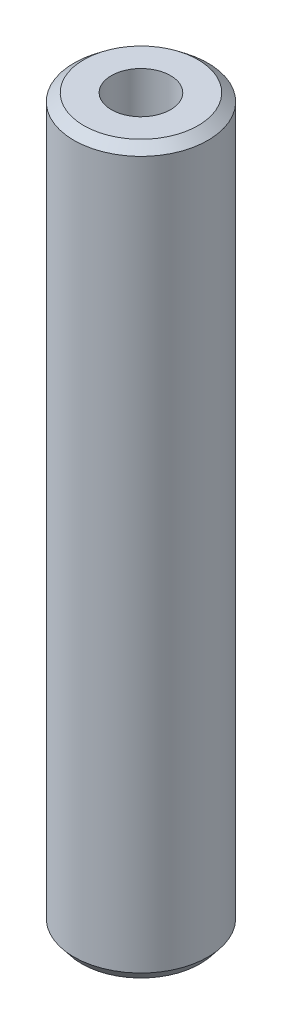
ISO-10303-21;
HEADER;
FILE_DESCRIPTION(('STEP AP214'),'2;1');
FILE_NAME('part.step','',(''),(''),'','','');
FILE_SCHEMA(('AUTOMOTIVE_DESIGN { 1 0 10303 214 1 1 1 1 }'));
ENDSEC;
DATA;
#1=APPLICATION_CONTEXT('core data for automotive mechanical design processes');
#2=APPLICATION_PROTOCOL_DEFINITION('international standard','automotive_design',2000,#1);
#3=PRODUCT_CONTEXT('',#1,'mechanical');
#4=PRODUCT('Part','Part','',(#3));
#5=PRODUCT_RELATED_PRODUCT_CATEGORY('part','',(#4));
#6=PRODUCT_DEFINITION_FORMATION('','',#4);
#7=PRODUCT_DEFINITION_CONTEXT('part definition',#1,'design');
#8=PRODUCT_DEFINITION('design','',#6,#7);
#9=PRODUCT_DEFINITION_SHAPE('','',#8);
#10=(LENGTH_UNIT() NAMED_UNIT(*) SI_UNIT(.MILLI.,.METRE.));
#11=(NAMED_UNIT(*) PLANE_ANGLE_UNIT() SI_UNIT($,.RADIAN.));
#12=(NAMED_UNIT(*) SI_UNIT($,.STERADIAN.) SOLID_ANGLE_UNIT());
#13=UNCERTAINTY_MEASURE_WITH_UNIT(LENGTH_MEASURE(1.E-05),#10,'distance_accuracy_value','');
#14=(GEOMETRIC_REPRESENTATION_CONTEXT(3) GLOBAL_UNCERTAINTY_ASSIGNED_CONTEXT((#13)) GLOBAL_UNIT_ASSIGNED_CONTEXT((#10,
#11,#12)) REPRESENTATION_CONTEXT('',''));
#15=CARTESIAN_POINT('',(0.,0.,0.));
#16=DIRECTION('',(0.,0.,1.));
#17=DIRECTION('',(1.,0.,0.));
#18=AXIS2_PLACEMENT_3D('',#15,#16,#17);
#19=CARTESIAN_POINT('',(0.,189.383427414071,0.));
#20=DIRECTION('',(0.,-1.,0.));
#21=DIRECTION('',(0.,0.,-1.));
#22=AXIS2_PLACEMENT_3D('',#19,#20,#21);
#23=CYLINDRICAL_SURFACE('',#22,17.5);
#24=CARTESIAN_POINT('',(0.,187.335210784093,0.));
#25=DIRECTION('',(0.,1.,0.));
#26=DIRECTION('',(0.,0.,1.));
#27=AXIS2_PLACEMENT_3D('',#24,#25,#26);
#28=CIRCLE('',#27,17.5);
#29=CARTESIAN_POINT('',(0.,187.335210784093,17.5));
#30=VERTEX_POINT('',#29);
#31=EDGE_CURVE('E50',#30,#30,#28,.F.);
#32=ORIENTED_EDGE('',*,*,#31,.T.);
#33=EDGE_LOOP('',(#32));
#34=FACE_BOUND('',#33,.T.);
#35=CARTESIAN_POINT('',(0.,2.57385600201263,0.));
#36=DIRECTION('',(0.,1.,0.));
#37=DIRECTION('',(0.,0.,1.));
#38=AXIS2_PLACEMENT_3D('',#35,#36,#37);
#39=CIRCLE('',#38,17.5);
#40=CARTESIAN_POINT('',(0.,2.57385600201263,17.5));
#41=VERTEX_POINT('',#40);
#42=EDGE_CURVE('E51',#41,#41,#39,.T.);
#43=ORIENTED_EDGE('',*,*,#42,.T.);
#44=EDGE_LOOP('',(#43));
#45=FACE_BOUND('',#44,.T.);
#46=ADVANCED_FACE('F39',(#34,#45),#23,.T.);
#47=CARTESIAN_POINT('',(0.,189.383427414071,0.));
#48=DIRECTION('',(0.,1.,0.));
#49=DIRECTION('',(0.,0.,1.));
#50=AXIS2_PLACEMENT_3D('',#47,#48,#49);
#51=PLANE('',#50);
#52=CARTESIAN_POINT('',(0.,189.383427414071,0.));
#53=DIRECTION('',(0.,1.,0.));
#54=DIRECTION('',(0.,0.,1.));
#55=AXIS2_PLACEMENT_3D('',#52,#53,#54);
#56=CIRCLE('',#55,14.9261439979873);
#57=CARTESIAN_POINT('',(0.,189.383427414071,14.9261439979873));
#58=VERTEX_POINT('',#57);
#59=EDGE_CURVE('E54',#58,#58,#56,.T.);
#60=ORIENTED_EDGE('',*,*,#59,.T.);
#61=EDGE_LOOP('',(#60));
#62=FACE_BOUND('',#61,.T.);
#63=CARTESIAN_POINT('',(0.,189.383427414071,0.));
#64=DIRECTION('',(0.,1.,0.));
#65=DIRECTION('',(0.,0.,1.));
#66=AXIS2_PLACEMENT_3D('',#63,#64,#65);
#67=CIRCLE('',#66,7.72820379664447);
#68=CARTESIAN_POINT('',(0.,189.383427414071,7.72820379664447));
#69=VERTEX_POINT('',#68);
#70=EDGE_CURVE('E58',#69,#69,#67,.T.);
#71=ORIENTED_EDGE('',*,*,#70,.F.);
#72=EDGE_LOOP('',(#71));
#73=FACE_BOUND('',#72,.T.);
#74=ADVANCED_FACE('F69',(#62,#73),#51,.T.);
#75=CARTESIAN_POINT('',(0.,0.,0.));
#76=DIRECTION('',(0.,1.,0.));
#77=DIRECTION('',(0.,0.,1.));
#78=AXIS2_PLACEMENT_3D('',#75,#76,#77);
#79=PLANE('',#78);
#80=CARTESIAN_POINT('',(0.,0.,0.));
#81=DIRECTION('',(0.,1.,0.));
#82=DIRECTION('',(0.,0.,1.));
#83=AXIS2_PLACEMENT_3D('',#80,#81,#82);
#84=CIRCLE('',#83,15.4517833700223);
#85=CARTESIAN_POINT('',(0.,0.,15.4517833700223));
#86=VERTEX_POINT('',#85);
#87=EDGE_CURVE('E10',#86,#86,#84,.F.);
#88=ORIENTED_EDGE('',*,*,#87,.T.);
#89=EDGE_LOOP('',(#88));
#90=FACE_BOUND('',#89,.T.);
#91=CARTESIAN_POINT('',(0.,0.,0.));
#92=DIRECTION('',(0.,1.,0.));
#93=DIRECTION('',(0.,0.,1.));
#94=AXIS2_PLACEMENT_3D('',#91,#92,#93);
#95=CIRCLE('',#94,7.72820379664447);
#96=CARTESIAN_POINT('',(0.,0.,7.72820379664447));
#97=VERTEX_POINT('',#96);
#98=EDGE_CURVE('E63',#97,#97,#95,.T.);
#99=ORIENTED_EDGE('',*,*,#98,.T.);
#100=EDGE_LOOP('',(#99));
#101=FACE_BOUND('',#100,.T.);
#102=ADVANCED_FACE('F75',(#90,#101),#79,.F.);
#103=CARTESIAN_POINT('',(0.,189.383427414071,0.));
#104=DIRECTION('',(0.,-1.,0.));
#105=DIRECTION('',(0.,0.,-1.));
#106=AXIS2_PLACEMENT_3D('',#103,#104,#105);
#107=CYLINDRICAL_SURFACE('',#106,7.72820379664447);
#108=ORIENTED_EDGE('',*,*,#70,.T.);
#109=EDGE_LOOP('',(#108));
#110=FACE_BOUND('',#109,.T.);
#111=ORIENTED_EDGE('',*,*,#98,.F.);
#112=EDGE_LOOP('',(#111));
#113=FACE_BOUND('',#112,.T.);
#114=ADVANCED_FACE('F70',(#110,#113),#107,.F.);
#115=CARTESIAN_POINT('',(0.,189.383427414071,0.));
#116=DIRECTION('',(0.,-1.,0.));
#117=DIRECTION('',(0.,0.,-1.));
#118=AXIS2_PLACEMENT_3D('',#115,#116,#117);
#119=CONICAL_SURFACE('',#118,14.9261439979873,0.89863540354098);
#120=ORIENTED_EDGE('',*,*,#31,.F.);
#121=EDGE_LOOP('',(#120));
#122=FACE_BOUND('',#121,.T.);
#123=ORIENTED_EDGE('',*,*,#59,.F.);
#124=EDGE_LOOP('',(#123));
#125=FACE_BOUND('',#124,.T.);
#126=ADVANCED_FACE('F81',(#122,#125),#119,.T.);
#127=CARTESIAN_POINT('',(0.,2.57385600201263,0.));
#128=DIRECTION('',(0.,1.,0.));
#129=DIRECTION('',(0.,0.,1.));
#130=AXIS2_PLACEMENT_3D('',#127,#128,#129);
#131=CONICAL_SURFACE('',#130,17.5,0.672160923253913);
#132=ORIENTED_EDGE('',*,*,#87,.F.);
#133=EDGE_LOOP('',(#132));
#134=FACE_BOUND('',#133,.T.);
#135=ORIENTED_EDGE('',*,*,#42,.F.);
#136=EDGE_LOOP('',(#135));
#137=FACE_BOUND('',#136,.T.);
#138=ADVANCED_FACE('F45',(#134,#137),#131,.T.);
#139=CLOSED_SHELL('',(#46,#74,#102,#114,#126,#138));
#140=MANIFOLD_SOLID_BREP('B2',#139);
#141=ADVANCED_BREP_SHAPE_REPRESENTATION('',(#18,#140),#14);
#142=SHAPE_DEFINITION_REPRESENTATION(#9,#141);
ENDSEC;
END-ISO-10303-21;
